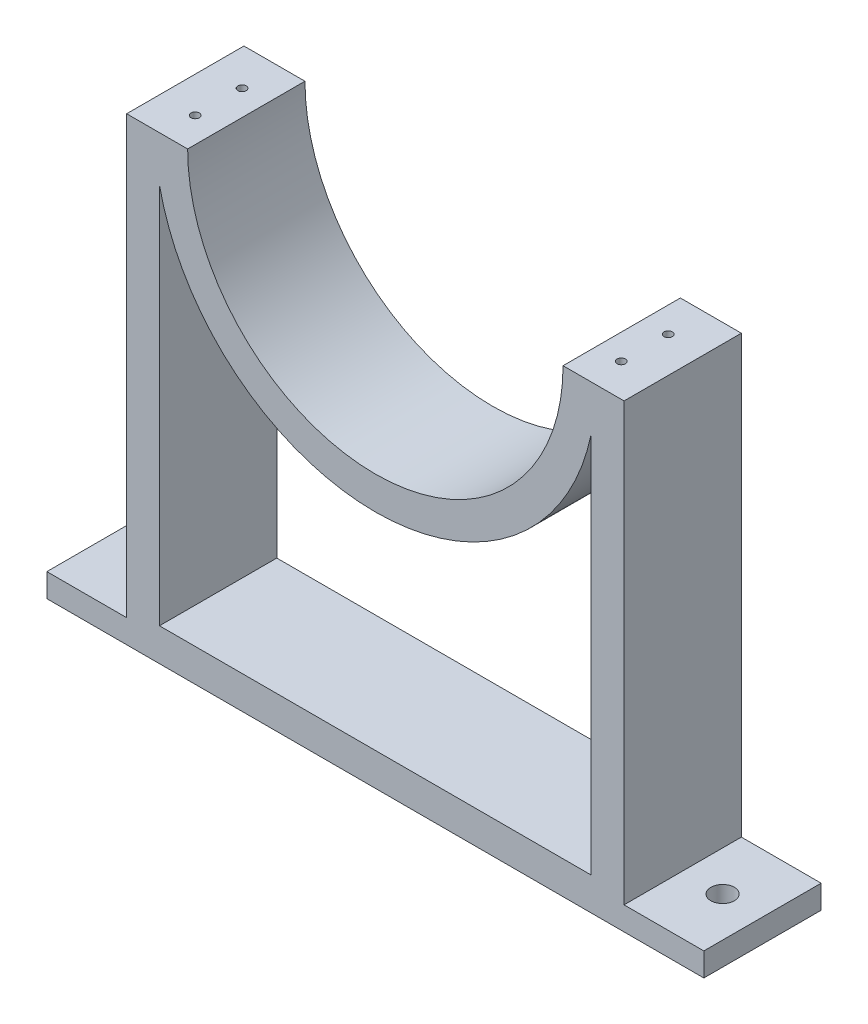
ISO-10303-21;
HEADER;
FILE_DESCRIPTION(('STEP AP214'),'2;1');
FILE_NAME('part.step','',(''),(''),'','','');
FILE_SCHEMA(('AUTOMOTIVE_DESIGN { 1 0 10303 214 1 1 1 1 }'));
ENDSEC;
DATA;
#1=APPLICATION_CONTEXT('core data for automotive mechanical design processes');
#2=APPLICATION_PROTOCOL_DEFINITION('international standard','automotive_design',2000,#1);
#3=PRODUCT_CONTEXT('',#1,'mechanical');
#4=PRODUCT('Part','Part','',(#3));
#5=PRODUCT_RELATED_PRODUCT_CATEGORY('part','',(#4));
#6=PRODUCT_DEFINITION_FORMATION('','',#4);
#7=PRODUCT_DEFINITION_CONTEXT('part definition',#1,'design');
#8=PRODUCT_DEFINITION('design','',#6,#7);
#9=PRODUCT_DEFINITION_SHAPE('','',#8);
#10=(LENGTH_UNIT() NAMED_UNIT(*) SI_UNIT(.MILLI.,.METRE.));
#11=(NAMED_UNIT(*) PLANE_ANGLE_UNIT() SI_UNIT($,.RADIAN.));
#12=(NAMED_UNIT(*) SI_UNIT($,.STERADIAN.) SOLID_ANGLE_UNIT());
#13=UNCERTAINTY_MEASURE_WITH_UNIT(LENGTH_MEASURE(1.E-05),#10,'distance_accuracy_value','');
#14=(GEOMETRIC_REPRESENTATION_CONTEXT(3) GLOBAL_UNCERTAINTY_ASSIGNED_CONTEXT((#13)) GLOBAL_UNIT_ASSIGNED_CONTEXT((#10,
#11,#12)) REPRESENTATION_CONTEXT('',''));
#15=CARTESIAN_POINT('',(0.,0.,0.));
#16=DIRECTION('',(0.,0.,1.));
#17=DIRECTION('',(1.,0.,0.));
#18=AXIS2_PLACEMENT_3D('',#15,#16,#17);
#19=CARTESIAN_POINT('',(0.,0.,15.875));
#20=DIRECTION('',(0.,0.,1.));
#21=DIRECTION('',(1.,0.,0.));
#22=AXIS2_PLACEMENT_3D('',#19,#20,#21);
#23=PLANE('',#22);
#24=CARTESIAN_POINT('',(0.,0.,15.875));
#25=DIRECTION('',(0.,0.,1.));
#26=DIRECTION('',(1.,0.,0.));
#27=AXIS2_PLACEMENT_3D('',#24,#25,#26);
#28=CIRCLE('',#27,50.8);
#29=CARTESIAN_POINT('',(-50.8,0.,15.875));
#30=VERTEX_POINT('',#29);
#31=CARTESIAN_POINT('',(50.8,0.,15.875));
#32=VERTEX_POINT('',#31);
#33=EDGE_CURVE('E284',#30,#32,#28,.T.);
#34=ORIENTED_EDGE('',*,*,#33,.F.);
#35=DIRECTION('',(-1.,0.,0.));
#36=VECTOR('',#35,1.);
#37=CARTESIAN_POINT('',(0.,0.,15.875));
#38=LINE('',#37,#36);
#39=CARTESIAN_POINT('',(-67.31,0.,15.875));
#40=VERTEX_POINT('',#39);
#41=EDGE_CURVE('E287',#30,#40,#38,.T.);
#42=ORIENTED_EDGE('',*,*,#41,.T.);
#43=DIRECTION('',(0.,-1.,0.));
#44=VECTOR('',#43,1.);
#45=CARTESIAN_POINT('',(-67.31,0.,15.875));
#46=LINE('',#45,#44);
#47=CARTESIAN_POINT('',(-67.31,-118.11,15.875));
#48=VERTEX_POINT('',#47);
#49=EDGE_CURVE('E290',#40,#48,#46,.T.);
#50=ORIENTED_EDGE('',*,*,#49,.T.);
#51=DIRECTION('',(-1.,0.,0.));
#52=VECTOR('',#51,1.);
#53=CARTESIAN_POINT('',(0.,-118.11,15.875));
#54=LINE('',#53,#52);
#55=CARTESIAN_POINT('',(-88.8999999999999,-118.11,15.875));
#56=VERTEX_POINT('',#55);
#57=EDGE_CURVE('E292',#48,#56,#54,.T.);
#58=ORIENTED_EDGE('',*,*,#57,.T.);
#59=DIRECTION('',(0.,-1.,0.));
#60=VECTOR('',#59,1.);
#61=CARTESIAN_POINT('',(-88.8999999999997,1.94289029309402E-13,15.875));
#62=LINE('',#61,#60);
#63=CARTESIAN_POINT('',(-88.9,-124.46,15.875));
#64=VERTEX_POINT('',#63);
#65=EDGE_CURVE('E294',#56,#64,#62,.T.);
#66=ORIENTED_EDGE('',*,*,#65,.T.);
#67=DIRECTION('',(1.,0.,0.));
#68=VECTOR('',#67,1.);
#69=CARTESIAN_POINT('',(0.,-124.46,15.875));
#70=LINE('',#69,#68);
#71=CARTESIAN_POINT('',(88.9,-124.46,15.875));
#72=VERTEX_POINT('',#71);
#73=EDGE_CURVE('E296',#64,#72,#70,.T.);
#74=ORIENTED_EDGE('',*,*,#73,.T.);
#75=DIRECTION('',(0.,-1.,0.));
#76=VECTOR('',#75,1.);
#77=CARTESIAN_POINT('',(88.8999999999997,1.94289029309402E-13,15.875));
#78=LINE('',#77,#76);
#79=CARTESIAN_POINT('',(88.9,-118.11,15.875));
#80=VERTEX_POINT('',#79);
#81=EDGE_CURVE('E298',#80,#72,#78,.T.);
#82=ORIENTED_EDGE('',*,*,#81,.F.);
#83=DIRECTION('',(1.,0.,0.));
#84=VECTOR('',#83,1.);
#85=CARTESIAN_POINT('',(1.51839325426676E-13,-118.11,15.875));
#86=LINE('',#85,#84);
#87=CARTESIAN_POINT('',(67.31,-118.11,15.875));
#88=VERTEX_POINT('',#87);
#89=EDGE_CURVE('E301',#88,#80,#86,.T.);
#90=ORIENTED_EDGE('',*,*,#89,.F.);
#91=DIRECTION('',(0.,-1.,0.));
#92=VECTOR('',#91,1.);
#93=CARTESIAN_POINT('',(67.31,0.,15.875));
#94=LINE('',#93,#92);
#95=CARTESIAN_POINT('',(67.31,0.,15.875));
#96=VERTEX_POINT('',#95);
#97=EDGE_CURVE('E304',#96,#88,#94,.T.);
#98=ORIENTED_EDGE('',*,*,#97,.F.);
#99=DIRECTION('',(1.,0.,0.));
#100=VECTOR('',#99,1.);
#101=CARTESIAN_POINT('',(0.,0.,15.875));
#102=LINE('',#101,#100);
#103=EDGE_CURVE('E307',#32,#96,#102,.T.);
#104=ORIENTED_EDGE('',*,*,#103,.F.);
#105=EDGE_LOOP('',(#34,#42,#50,#58,#66,#74,#82,#90,#98,#104));
#106=FACE_BOUND('',#105,.T.);
#107=CARTESIAN_POINT('',(0.,0.,15.875));
#108=DIRECTION('',(0.,0.,1.));
#109=DIRECTION('',(1.,0.,0.));
#110=AXIS2_PLACEMENT_3D('',#107,#108,#109);
#111=CIRCLE('',#110,59.69);
#112=CARTESIAN_POINT('',(-58.42,-12.2474364664611,15.875));
#113=VERTEX_POINT('',#112);
#114=CARTESIAN_POINT('',(58.42,-12.247436466461,15.875));
#115=VERTEX_POINT('',#114);
#116=EDGE_CURVE('E260',#113,#115,#111,.T.);
#117=ORIENTED_EDGE('',*,*,#116,.T.);
#118=DIRECTION('',(0.,-1.,0.));
#119=VECTOR('',#118,1.);
#120=CARTESIAN_POINT('',(58.42,0.,15.875));
#121=LINE('',#120,#119);
#122=CARTESIAN_POINT('',(58.42,-115.57,15.875));
#123=VERTEX_POINT('',#122);
#124=EDGE_CURVE('E272',#115,#123,#121,.T.);
#125=ORIENTED_EDGE('',*,*,#124,.T.);
#126=DIRECTION('',(1.,0.,0.));
#127=VECTOR('',#126,1.);
#128=CARTESIAN_POINT('',(0.,-115.57,15.875));
#129=LINE('',#128,#127);
#130=CARTESIAN_POINT('',(-58.42,-115.57,15.875));
#131=VERTEX_POINT('',#130);
#132=EDGE_CURVE('E269',#131,#123,#129,.T.);
#133=ORIENTED_EDGE('',*,*,#132,.F.);
#134=DIRECTION('',(0.,-1.,0.));
#135=VECTOR('',#134,1.);
#136=CARTESIAN_POINT('',(-58.42,0.,15.875));
#137=LINE('',#136,#135);
#138=EDGE_CURVE('E123',#113,#131,#137,.T.);
#139=ORIENTED_EDGE('',*,*,#138,.F.);
#140=EDGE_LOOP('',(#117,#125,#133,#139));
#141=FACE_BOUND('',#140,.T.);
#142=ADVANCED_FACE('F100',(#106,#141),#23,.T.);
#143=CARTESIAN_POINT('',(0.,0.,15.875));
#144=DIRECTION('',(0.,0.,-1.));
#145=DIRECTION('',(-1.,0.,0.));
#146=AXIS2_PLACEMENT_3D('',#143,#144,#145);
#147=CYLINDRICAL_SURFACE('',#146,50.8);
#148=CARTESIAN_POINT('',(0.,0.,-15.875));
#149=DIRECTION('',(0.,0.,1.));
#150=DIRECTION('',(1.,0.,0.));
#151=AXIS2_PLACEMENT_3D('',#148,#149,#150);
#152=CIRCLE('',#151,50.8);
#153=CARTESIAN_POINT('',(-50.8,0.,-15.875));
#154=VERTEX_POINT('',#153);
#155=CARTESIAN_POINT('',(50.8,0.,-15.875));
#156=VERTEX_POINT('',#155);
#157=EDGE_CURVE('E283',#154,#156,#152,.T.);
#158=ORIENTED_EDGE('',*,*,#157,.F.);
#159=DIRECTION('',(0.,0.,-1.));
#160=VECTOR('',#159,1.);
#161=CARTESIAN_POINT('',(-50.8,0.,15.875));
#162=LINE('',#161,#160);
#163=EDGE_CURVE('E12',#30,#154,#162,.T.);
#164=ORIENTED_EDGE('',*,*,#163,.F.);
#165=ORIENTED_EDGE('',*,*,#33,.T.);
#166=DIRECTION('',(0.,0.,-1.));
#167=VECTOR('',#166,1.);
#168=CARTESIAN_POINT('',(50.8,0.,15.875));
#169=LINE('',#168,#167);
#170=EDGE_CURVE('E310',#32,#156,#169,.T.);
#171=ORIENTED_EDGE('',*,*,#170,.T.);
#172=EDGE_LOOP('',(#158,#164,#165,#171));
#173=FACE_BOUND('',#172,.T.);
#174=ADVANCED_FACE('F102',(#173),#147,.F.);
#175=CARTESIAN_POINT('',(0.,0.,-15.875));
#176=DIRECTION('',(0.,0.,1.));
#177=DIRECTION('',(1.,0.,0.));
#178=AXIS2_PLACEMENT_3D('',#175,#176,#177);
#179=PLANE('',#178);
#180=CARTESIAN_POINT('',(0.,0.,-15.875));
#181=DIRECTION('',(0.,0.,1.));
#182=DIRECTION('',(1.,0.,0.));
#183=AXIS2_PLACEMENT_3D('',#180,#181,#182);
#184=CIRCLE('',#183,59.69);
#185=CARTESIAN_POINT('',(-58.42,-12.2474364664611,-15.875));
#186=VERTEX_POINT('',#185);
#187=CARTESIAN_POINT('',(58.42,-12.247436466461,-15.875));
#188=VERTEX_POINT('',#187);
#189=EDGE_CURVE('E247',#186,#188,#184,.T.);
#190=ORIENTED_EDGE('',*,*,#189,.F.);
#191=DIRECTION('',(0.,-1.,0.));
#192=VECTOR('',#191,1.);
#193=CARTESIAN_POINT('',(-58.42,0.,-15.875));
#194=LINE('',#193,#192);
#195=CARTESIAN_POINT('',(-58.42,-115.57,-15.875));
#196=VERTEX_POINT('',#195);
#197=EDGE_CURVE('E258',#186,#196,#194,.T.);
#198=ORIENTED_EDGE('',*,*,#197,.T.);
#199=DIRECTION('',(1.,0.,0.));
#200=VECTOR('',#199,1.);
#201=CARTESIAN_POINT('',(0.,-115.57,-15.875));
#202=LINE('',#201,#200);
#203=CARTESIAN_POINT('',(58.42,-115.57,-15.875));
#204=VERTEX_POINT('',#203);
#205=EDGE_CURVE('E261',#196,#204,#202,.T.);
#206=ORIENTED_EDGE('',*,*,#205,.T.);
#207=DIRECTION('',(0.,-1.,0.));
#208=VECTOR('',#207,1.);
#209=CARTESIAN_POINT('',(58.42,0.,-15.875));
#210=LINE('',#209,#208);
#211=EDGE_CURVE('E115',#188,#204,#210,.T.);
#212=ORIENTED_EDGE('',*,*,#211,.F.);
#213=EDGE_LOOP('',(#190,#198,#206,#212));
#214=FACE_BOUND('',#213,.T.);
#215=ORIENTED_EDGE('',*,*,#157,.T.);
#216=DIRECTION('',(1.,0.,0.));
#217=VECTOR('',#216,1.);
#218=CARTESIAN_POINT('',(0.,0.,-15.875));
#219=LINE('',#218,#217);
#220=CARTESIAN_POINT('',(67.31,0.,-15.875));
#221=VERTEX_POINT('',#220);
#222=EDGE_CURVE('E288',#156,#221,#219,.T.);
#223=ORIENTED_EDGE('',*,*,#222,.T.);
#224=DIRECTION('',(0.,-1.,0.));
#225=VECTOR('',#224,1.);
#226=CARTESIAN_POINT('',(67.31,0.,-15.875));
#227=LINE('',#226,#225);
#228=CARTESIAN_POINT('',(67.31,-118.11,-15.875));
#229=VERTEX_POINT('',#228);
#230=EDGE_CURVE('E330',#221,#229,#227,.T.);
#231=ORIENTED_EDGE('',*,*,#230,.T.);
#232=DIRECTION('',(1.,0.,0.));
#233=VECTOR('',#232,1.);
#234=CARTESIAN_POINT('',(1.51839325426676E-13,-118.11,-15.875));
#235=LINE('',#234,#233);
#236=CARTESIAN_POINT('',(88.9,-118.11,-15.875));
#237=VERTEX_POINT('',#236);
#238=EDGE_CURVE('E327',#229,#237,#235,.T.);
#239=ORIENTED_EDGE('',*,*,#238,.T.);
#240=DIRECTION('',(0.,-1.,0.));
#241=VECTOR('',#240,1.);
#242=CARTESIAN_POINT('',(88.8999999999997,1.94289029309402E-13,-15.875));
#243=LINE('',#242,#241);
#244=CARTESIAN_POINT('',(88.9,-124.46,-15.875));
#245=VERTEX_POINT('',#244);
#246=EDGE_CURVE('E324',#237,#245,#243,.T.);
#247=ORIENTED_EDGE('',*,*,#246,.T.);
#248=DIRECTION('',(1.,0.,0.));
#249=VECTOR('',#248,1.);
#250=CARTESIAN_POINT('',(0.,-124.46,-15.875));
#251=LINE('',#250,#249);
#252=CARTESIAN_POINT('',(-88.9,-124.46,-15.875));
#253=VERTEX_POINT('',#252);
#254=EDGE_CURVE('E321',#253,#245,#251,.T.);
#255=ORIENTED_EDGE('',*,*,#254,.F.);
#256=DIRECTION('',(0.,-1.,0.));
#257=VECTOR('',#256,1.);
#258=CARTESIAN_POINT('',(-88.8999999999997,1.94289029309402E-13,-15.875));
#259=LINE('',#258,#257);
#260=CARTESIAN_POINT('',(-88.8999999999999,-118.11,-15.875));
#261=VERTEX_POINT('',#260);
#262=EDGE_CURVE('E319',#261,#253,#259,.T.);
#263=ORIENTED_EDGE('',*,*,#262,.F.);
#264=DIRECTION('',(-1.,0.,0.));
#265=VECTOR('',#264,1.);
#266=CARTESIAN_POINT('',(0.,-118.11,-15.875));
#267=LINE('',#266,#265);
#268=CARTESIAN_POINT('',(-67.31,-118.11,-15.875));
#269=VERTEX_POINT('',#268);
#270=EDGE_CURVE('E317',#269,#261,#267,.T.);
#271=ORIENTED_EDGE('',*,*,#270,.F.);
#272=DIRECTION('',(0.,-1.,0.));
#273=VECTOR('',#272,1.);
#274=CARTESIAN_POINT('',(-67.31,0.,-15.875));
#275=LINE('',#274,#273);
#276=CARTESIAN_POINT('',(-67.31,0.,-15.875));
#277=VERTEX_POINT('',#276);
#278=EDGE_CURVE('E315',#277,#269,#275,.T.);
#279=ORIENTED_EDGE('',*,*,#278,.F.);
#280=DIRECTION('',(-1.,0.,0.));
#281=VECTOR('',#280,1.);
#282=CARTESIAN_POINT('',(0.,0.,-15.875));
#283=LINE('',#282,#281);
#284=EDGE_CURVE('E313',#154,#277,#283,.T.);
#285=ORIENTED_EDGE('',*,*,#284,.F.);
#286=EDGE_LOOP('',(#215,#223,#231,#239,#247,#255,#263,#271,#279,#285));
#287=FACE_BOUND('',#286,.T.);
#288=ADVANCED_FACE('F364',(#214,#287),#179,.F.);
#289=CARTESIAN_POINT('',(0.,0.,15.875));
#290=DIRECTION('',(0.,1.,0.));
#291=DIRECTION('',(-1.,0.,0.));
#292=AXIS2_PLACEMENT_3D('',#289,#290,#291);
#293=PLANE('',#292);
#294=CARTESIAN_POINT('',(57.658,0.,6.985));
#295=DIRECTION('',(0.,1.,0.));
#296=DIRECTION('',(0.,0.,1.));
#297=AXIS2_PLACEMENT_3D('',#294,#295,#296);
#298=CIRCLE('',#297,1.13029999999999);
#299=CARTESIAN_POINT('',(57.658,0.,8.1153));
#300=VERTEX_POINT('',#299);
#301=EDGE_CURVE('E231',#300,#300,#298,.T.);
#302=ORIENTED_EDGE('',*,*,#301,.F.);
#303=EDGE_LOOP('',(#302));
#304=FACE_BOUND('',#303,.T.);
#305=CARTESIAN_POINT('',(57.658,0.,-5.715));
#306=DIRECTION('',(0.,1.,0.));
#307=DIRECTION('',(0.,0.,1.));
#308=AXIS2_PLACEMENT_3D('',#305,#306,#307);
#309=CIRCLE('',#308,1.13029999999999);
#310=CARTESIAN_POINT('',(57.658,0.,-4.5847));
#311=VERTEX_POINT('',#310);
#312=EDGE_CURVE('E237',#311,#311,#309,.T.);
#313=ORIENTED_EDGE('',*,*,#312,.F.);
#314=EDGE_LOOP('',(#313));
#315=FACE_BOUND('',#314,.T.);
#316=ORIENTED_EDGE('',*,*,#222,.F.);
#317=ORIENTED_EDGE('',*,*,#170,.F.);
#318=ORIENTED_EDGE('',*,*,#103,.T.);
#319=DIRECTION('',(0.,0.,-1.));
#320=VECTOR('',#319,1.);
#321=CARTESIAN_POINT('',(67.31,0.,15.875));
#322=LINE('',#321,#320);
#323=EDGE_CURVE('E336',#96,#221,#322,.T.);
#324=ORIENTED_EDGE('',*,*,#323,.T.);
#325=EDGE_LOOP('',(#316,#317,#318,#324));
#326=FACE_BOUND('',#325,.T.);
#327=ADVANCED_FACE('F387',(#304,#315,#326),#293,.T.);
#328=CARTESIAN_POINT('',(67.31,0.,15.875));
#329=DIRECTION('',(1.,0.,0.));
#330=DIRECTION('',(0.,1.,0.));
#331=AXIS2_PLACEMENT_3D('',#328,#329,#330);
#332=PLANE('',#331);
#333=ORIENTED_EDGE('',*,*,#230,.F.);
#334=ORIENTED_EDGE('',*,*,#323,.F.);
#335=ORIENTED_EDGE('',*,*,#97,.T.);
#336=DIRECTION('',(0.,0.,-1.));
#337=VECTOR('',#336,1.);
#338=CARTESIAN_POINT('',(67.31,-118.11,15.875));
#339=LINE('',#338,#337);
#340=EDGE_CURVE('E338',#88,#229,#339,.T.);
#341=ORIENTED_EDGE('',*,*,#340,.T.);
#342=EDGE_LOOP('',(#333,#334,#335,#341));
#343=FACE_BOUND('',#342,.T.);
#344=ADVANCED_FACE('F391',(#343),#332,.T.);
#345=CARTESIAN_POINT('',(1.51839325426676E-13,-118.11,15.875));
#346=DIRECTION('',(0.,1.,0.));
#347=DIRECTION('',(-1.,0.,0.));
#348=AXIS2_PLACEMENT_3D('',#345,#346,#347);
#349=PLANE('',#348);
#350=CARTESIAN_POINT('',(78.1049999999999,-118.11,0.));
#351=DIRECTION('',(0.,1.,0.));
#352=DIRECTION('',(0.,0.,-1.));
#353=AXIS2_PLACEMENT_3D('',#350,#351,#352);
#354=CIRCLE('',#353,3.175);
#355=CARTESIAN_POINT('',(78.1049999999999,-118.11,-3.175));
#356=VERTEX_POINT('',#355);
#357=EDGE_CURVE('E243',#356,#356,#354,.T.);
#358=ORIENTED_EDGE('',*,*,#357,.F.);
#359=EDGE_LOOP('',(#358));
#360=FACE_BOUND('',#359,.T.);
#361=ORIENTED_EDGE('',*,*,#238,.F.);
#362=ORIENTED_EDGE('',*,*,#340,.F.);
#363=ORIENTED_EDGE('',*,*,#89,.T.);
#364=DIRECTION('',(0.,0.,-1.));
#365=VECTOR('',#364,1.);
#366=CARTESIAN_POINT('',(88.9,-118.11,15.875));
#367=LINE('',#366,#365);
#368=EDGE_CURVE('E340',#80,#237,#367,.T.);
#369=ORIENTED_EDGE('',*,*,#368,.T.);
#370=EDGE_LOOP('',(#361,#362,#363,#369));
#371=FACE_BOUND('',#370,.T.);
#372=ADVANCED_FACE('F395',(#360,#371),#349,.T.);
#373=CARTESIAN_POINT('',(88.8999999999997,1.94289029309402E-13,15.875));
#374=DIRECTION('',(1.,0.,0.));
#375=DIRECTION('',(0.,1.,0.));
#376=AXIS2_PLACEMENT_3D('',#373,#374,#375);
#377=PLANE('',#376);
#378=ORIENTED_EDGE('',*,*,#246,.F.);
#379=ORIENTED_EDGE('',*,*,#368,.F.);
#380=ORIENTED_EDGE('',*,*,#81,.T.);
#381=DIRECTION('',(0.,0.,-1.));
#382=VECTOR('',#381,1.);
#383=CARTESIAN_POINT('',(88.9,-124.46,15.875));
#384=LINE('',#383,#382);
#385=EDGE_CURVE('E342',#72,#245,#384,.T.);
#386=ORIENTED_EDGE('',*,*,#385,.T.);
#387=EDGE_LOOP('',(#378,#379,#380,#386));
#388=FACE_BOUND('',#387,.T.);
#389=ADVANCED_FACE('F398',(#388),#377,.T.);
#390=CARTESIAN_POINT('',(0.,-124.46,15.875));
#391=DIRECTION('',(0.,1.,0.));
#392=DIRECTION('',(-1.,0.,0.));
#393=AXIS2_PLACEMENT_3D('',#390,#391,#392);
#394=PLANE('',#393);
#395=CARTESIAN_POINT('',(-78.105,-124.46,0.));
#396=DIRECTION('',(0.,1.,0.));
#397=DIRECTION('',(0.,0.,1.));
#398=AXIS2_PLACEMENT_3D('',#395,#396,#397);
#399=CIRCLE('',#398,3.175);
#400=CARTESIAN_POINT('',(-78.105,-124.46,3.175));
#401=VERTEX_POINT('',#400);
#402=EDGE_CURVE('E244',#401,#401,#399,.T.);
#403=ORIENTED_EDGE('',*,*,#402,.T.);
#404=EDGE_LOOP('',(#403));
#405=FACE_BOUND('',#404,.T.);
#406=CARTESIAN_POINT('',(78.1049999999999,-124.46,0.));
#407=DIRECTION('',(0.,1.,0.));
#408=DIRECTION('',(0.,0.,-1.));
#409=AXIS2_PLACEMENT_3D('',#406,#407,#408);
#410=CIRCLE('',#409,3.175);
#411=CARTESIAN_POINT('',(78.1049999999999,-124.46,-3.175));
#412=VERTEX_POINT('',#411);
#413=EDGE_CURVE('E251',#412,#412,#410,.T.);
#414=ORIENTED_EDGE('',*,*,#413,.T.);
#415=EDGE_LOOP('',(#414));
#416=FACE_BOUND('',#415,.T.);
#417=ORIENTED_EDGE('',*,*,#254,.T.);
#418=ORIENTED_EDGE('',*,*,#385,.F.);
#419=ORIENTED_EDGE('',*,*,#73,.F.);
#420=DIRECTION('',(0.,0.,-1.));
#421=VECTOR('',#420,1.);
#422=CARTESIAN_POINT('',(-88.9,-124.46,15.875));
#423=LINE('',#422,#421);
#424=EDGE_CURVE('E344',#64,#253,#423,.T.);
#425=ORIENTED_EDGE('',*,*,#424,.T.);
#426=EDGE_LOOP('',(#417,#418,#419,#425));
#427=FACE_BOUND('',#426,.T.);
#428=ADVANCED_FACE('F400',(#405,#416,#427),#394,.F.);
#429=CARTESIAN_POINT('',(-88.8999999999997,1.94289029309402E-13,15.875));
#430=DIRECTION('',(1.,0.,0.));
#431=DIRECTION('',(0.,1.,0.));
#432=AXIS2_PLACEMENT_3D('',#429,#430,#431);
#433=PLANE('',#432);
#434=ORIENTED_EDGE('',*,*,#262,.T.);
#435=ORIENTED_EDGE('',*,*,#424,.F.);
#436=ORIENTED_EDGE('',*,*,#65,.F.);
#437=DIRECTION('',(0.,0.,-1.));
#438=VECTOR('',#437,1.);
#439=CARTESIAN_POINT('',(-88.8999999999999,-118.11,15.875));
#440=LINE('',#439,#438);
#441=EDGE_CURVE('E347',#56,#261,#440,.T.);
#442=ORIENTED_EDGE('',*,*,#441,.T.);
#443=EDGE_LOOP('',(#434,#435,#436,#442));
#444=FACE_BOUND('',#443,.T.);
#445=ADVANCED_FACE('F374',(#444),#433,.F.);
#446=CARTESIAN_POINT('',(0.,-118.11,15.875));
#447=DIRECTION('',(0.,-1.,0.));
#448=DIRECTION('',(1.,0.,0.));
#449=AXIS2_PLACEMENT_3D('',#446,#447,#448);
#450=PLANE('',#449);
#451=CARTESIAN_POINT('',(-78.105,-118.11,0.));
#452=DIRECTION('',(0.,1.,0.));
#453=DIRECTION('',(0.,0.,1.));
#454=AXIS2_PLACEMENT_3D('',#451,#452,#453);
#455=CIRCLE('',#454,3.175);
#456=CARTESIAN_POINT('',(-78.105,-118.11,3.175));
#457=VERTEX_POINT('',#456);
#458=EDGE_CURVE('E248',#457,#457,#455,.T.);
#459=ORIENTED_EDGE('',*,*,#458,.F.);
#460=EDGE_LOOP('',(#459));
#461=FACE_BOUND('',#460,.T.);
#462=ORIENTED_EDGE('',*,*,#270,.T.);
#463=ORIENTED_EDGE('',*,*,#441,.F.);
#464=ORIENTED_EDGE('',*,*,#57,.F.);
#465=DIRECTION('',(0.,0.,-1.));
#466=VECTOR('',#465,1.);
#467=CARTESIAN_POINT('',(-67.31,-118.11,15.875));
#468=LINE('',#467,#466);
#469=EDGE_CURVE('E350',#48,#269,#468,.T.);
#470=ORIENTED_EDGE('',*,*,#469,.T.);
#471=EDGE_LOOP('',(#462,#463,#464,#470));
#472=FACE_BOUND('',#471,.T.);
#473=ADVANCED_FACE('F370',(#461,#472),#450,.F.);
#474=CARTESIAN_POINT('',(-67.31,0.,15.875));
#475=DIRECTION('',(1.,0.,0.));
#476=DIRECTION('',(0.,1.,0.));
#477=AXIS2_PLACEMENT_3D('',#474,#475,#476);
#478=PLANE('',#477);
#479=ORIENTED_EDGE('',*,*,#278,.T.);
#480=ORIENTED_EDGE('',*,*,#469,.F.);
#481=ORIENTED_EDGE('',*,*,#49,.F.);
#482=DIRECTION('',(0.,0.,-1.));
#483=VECTOR('',#482,1.);
#484=CARTESIAN_POINT('',(-67.31,0.,15.875));
#485=LINE('',#484,#483);
#486=EDGE_CURVE('E108',#40,#277,#485,.T.);
#487=ORIENTED_EDGE('',*,*,#486,.T.);
#488=EDGE_LOOP('',(#479,#480,#481,#487));
#489=FACE_BOUND('',#488,.T.);
#490=ADVANCED_FACE('F357',(#489),#478,.F.);
#491=CARTESIAN_POINT('',(0.,0.,15.875));
#492=DIRECTION('',(0.,-1.,0.));
#493=DIRECTION('',(1.,0.,0.));
#494=AXIS2_PLACEMENT_3D('',#491,#492,#493);
#495=PLANE('',#494);
#496=CARTESIAN_POINT('',(-57.658,0.,-5.715));
#497=DIRECTION('',(0.,1.,0.));
#498=DIRECTION('',(0.,0.,1.));
#499=AXIS2_PLACEMENT_3D('',#496,#497,#498);
#500=CIRCLE('',#499,1.13029999999999);
#501=CARTESIAN_POINT('',(-57.658,0.,-4.5847));
#502=VERTEX_POINT('',#501);
#503=EDGE_CURVE('E221',#502,#502,#500,.T.);
#504=ORIENTED_EDGE('',*,*,#503,.F.);
#505=EDGE_LOOP('',(#504));
#506=FACE_BOUND('',#505,.T.);
#507=CARTESIAN_POINT('',(-57.658,0.,6.985));
#508=DIRECTION('',(0.,1.,0.));
#509=DIRECTION('',(0.,0.,1.));
#510=AXIS2_PLACEMENT_3D('',#507,#508,#509);
#511=CIRCLE('',#510,1.13029999999999);
#512=CARTESIAN_POINT('',(-57.658,0.,8.1153));
#513=VERTEX_POINT('',#512);
#514=EDGE_CURVE('E220',#513,#513,#511,.T.);
#515=ORIENTED_EDGE('',*,*,#514,.F.);
#516=EDGE_LOOP('',(#515));
#517=FACE_BOUND('',#516,.T.);
#518=ORIENTED_EDGE('',*,*,#284,.T.);
#519=ORIENTED_EDGE('',*,*,#486,.F.);
#520=ORIENTED_EDGE('',*,*,#41,.F.);
#521=ORIENTED_EDGE('',*,*,#163,.T.);
#522=EDGE_LOOP('',(#518,#519,#520,#521));
#523=FACE_BOUND('',#522,.T.);
#524=ADVANCED_FACE('F383',(#506,#517,#523),#495,.F.);
#525=CARTESIAN_POINT('',(0.,0.,15.875));
#526=DIRECTION('',(0.,0.,-1.));
#527=DIRECTION('',(-1.,0.,0.));
#528=AXIS2_PLACEMENT_3D('',#525,#526,#527);
#529=CYLINDRICAL_SURFACE('',#528,59.69);
#530=ORIENTED_EDGE('',*,*,#116,.F.);
#531=DIRECTION('',(0.,0.,-1.));
#532=VECTOR('',#531,1.);
#533=CARTESIAN_POINT('',(-58.42,-12.2474364664611,15.875));
#534=LINE('',#533,#532);
#535=EDGE_CURVE('E275',#186,#113,#534,.F.);
#536=ORIENTED_EDGE('',*,*,#535,.F.);
#537=ORIENTED_EDGE('',*,*,#189,.T.);
#538=DIRECTION('',(0.,0.,-1.));
#539=VECTOR('',#538,1.);
#540=CARTESIAN_POINT('',(58.42,-12.247436466461,15.875));
#541=LINE('',#540,#539);
#542=EDGE_CURVE('E277',#115,#188,#541,.T.);
#543=ORIENTED_EDGE('',*,*,#542,.F.);
#544=EDGE_LOOP('',(#530,#536,#537,#543));
#545=FACE_BOUND('',#544,.T.);
#546=ADVANCED_FACE('F453',(#545),#529,.T.);
#547=CARTESIAN_POINT('',(58.42,0.,15.875));
#548=DIRECTION('',(1.,0.,0.));
#549=DIRECTION('',(0.,1.,0.));
#550=AXIS2_PLACEMENT_3D('',#547,#548,#549);
#551=PLANE('',#550);
#552=DIRECTION('',(0.,0.,1.));
#553=VECTOR('',#552,1.);
#554=CARTESIAN_POINT('',(58.42,-115.57,15.875));
#555=LINE('',#554,#553);
#556=EDGE_CURVE('E281',#204,#123,#555,.T.);
#557=ORIENTED_EDGE('',*,*,#556,.T.);
#558=ORIENTED_EDGE('',*,*,#124,.F.);
#559=ORIENTED_EDGE('',*,*,#542,.T.);
#560=ORIENTED_EDGE('',*,*,#211,.T.);
#561=EDGE_LOOP('',(#557,#558,#559,#560));
#562=FACE_BOUND('',#561,.T.);
#563=ADVANCED_FACE('F456',(#562),#551,.F.);
#564=CARTESIAN_POINT('',(0.,-115.57,15.875));
#565=DIRECTION('',(0.,1.,0.));
#566=DIRECTION('',(-1.,0.,0.));
#567=AXIS2_PLACEMENT_3D('',#564,#565,#566);
#568=PLANE('',#567);
#569=ORIENTED_EDGE('',*,*,#205,.F.);
#570=DIRECTION('',(0.,0.,-1.));
#571=VECTOR('',#570,1.);
#572=CARTESIAN_POINT('',(-58.42,-115.57,15.875));
#573=LINE('',#572,#571);
#574=EDGE_CURVE('E279',#131,#196,#573,.T.);
#575=ORIENTED_EDGE('',*,*,#574,.F.);
#576=ORIENTED_EDGE('',*,*,#132,.T.);
#577=ORIENTED_EDGE('',*,*,#556,.F.);
#578=EDGE_LOOP('',(#569,#575,#576,#577));
#579=FACE_BOUND('',#578,.T.);
#580=ADVANCED_FACE('F460',(#579),#568,.T.);
#581=CARTESIAN_POINT('',(-58.42,0.,15.875));
#582=DIRECTION('',(1.,0.,0.));
#583=DIRECTION('',(0.,1.,0.));
#584=AXIS2_PLACEMENT_3D('',#581,#582,#583);
#585=PLANE('',#584);
#586=ORIENTED_EDGE('',*,*,#574,.T.);
#587=ORIENTED_EDGE('',*,*,#197,.F.);
#588=ORIENTED_EDGE('',*,*,#535,.T.);
#589=ORIENTED_EDGE('',*,*,#138,.T.);
#590=EDGE_LOOP('',(#586,#587,#588,#589));
#591=FACE_BOUND('',#590,.T.);
#592=ADVANCED_FACE('F448',(#591),#585,.T.);
#593=CARTESIAN_POINT('',(-78.105,-124.46,0.));
#594=DIRECTION('',(0.,1.,0.));
#595=DIRECTION('',(0.,0.,1.));
#596=AXIS2_PLACEMENT_3D('',#593,#594,#595);
#597=CYLINDRICAL_SURFACE('',#596,3.175);
#598=ORIENTED_EDGE('',*,*,#402,.F.);
#599=EDGE_LOOP('',(#598));
#600=FACE_BOUND('',#599,.T.);
#601=ORIENTED_EDGE('',*,*,#458,.T.);
#602=EDGE_LOOP('',(#601));
#603=FACE_BOUND('',#602,.T.);
#604=ADVANCED_FACE('F438',(#600,#603),#597,.F.);
#605=CARTESIAN_POINT('',(78.1049999999999,-124.46,0.));
#606=DIRECTION('',(0.,1.,0.));
#607=DIRECTION('',(0.,0.,1.));
#608=AXIS2_PLACEMENT_3D('',#605,#606,#607);
#609=CYLINDRICAL_SURFACE('',#608,3.175);
#610=ORIENTED_EDGE('',*,*,#413,.F.);
#611=EDGE_LOOP('',(#610));
#612=FACE_BOUND('',#611,.T.);
#613=ORIENTED_EDGE('',*,*,#357,.T.);
#614=EDGE_LOOP('',(#613));
#615=FACE_BOUND('',#614,.T.);
#616=ADVANCED_FACE('F435',(#612,#615),#609,.F.);
#617=CARTESIAN_POINT('',(57.658,-7.61999999999998,-5.715));
#618=DIRECTION('',(0.,1.,0.));
#619=DIRECTION('',(0.,0.,1.));
#620=AXIS2_PLACEMENT_3D('',#617,#618,#619);
#621=CONICAL_SURFACE('',#620,1.13029999999999,1.02974425867665);
#622=CARTESIAN_POINT('',(57.658,-8.29915275768683,-5.715));
#623=VERTEX_POINT('',#622);
#624=VERTEX_LOOP('',#623);
#625=FACE_BOUND('',#624,.T.);
#626=CARTESIAN_POINT('',(57.658,-7.61999999999998,-5.715));
#627=DIRECTION('',(0.,1.,0.));
#628=DIRECTION('',(0.,0.,1.));
#629=AXIS2_PLACEMENT_3D('',#626,#627,#628);
#630=CIRCLE('',#629,1.13029999999999);
#631=CARTESIAN_POINT('',(57.658,-7.61999999999998,-4.5847));
#632=VERTEX_POINT('',#631);
#633=EDGE_CURVE('E240',#632,#632,#630,.T.);
#634=ORIENTED_EDGE('',*,*,#633,.T.);
#635=EDGE_LOOP('',(#634));
#636=FACE_BOUND('',#635,.T.);
#637=ADVANCED_FACE('F437',(#625,#636),#621,.F.);
#638=CARTESIAN_POINT('',(57.658,0.,-5.715));
#639=DIRECTION('',(0.,1.,0.));
#640=DIRECTION('',(0.,0.,1.));
#641=AXIS2_PLACEMENT_3D('',#638,#639,#640);
#642=CYLINDRICAL_SURFACE('',#641,1.13029999999999);
#643=ORIENTED_EDGE('',*,*,#633,.F.);
#644=EDGE_LOOP('',(#643));
#645=FACE_BOUND('',#644,.T.);
#646=ORIENTED_EDGE('',*,*,#312,.T.);
#647=EDGE_LOOP('',(#646));
#648=FACE_BOUND('',#647,.T.);
#649=ADVANCED_FACE('F445',(#645,#648),#642,.F.);
#650=CARTESIAN_POINT('',(57.658,-7.61999999999998,6.985));
#651=DIRECTION('',(0.,1.,0.));
#652=DIRECTION('',(0.,0.,1.));
#653=AXIS2_PLACEMENT_3D('',#650,#651,#652);
#654=CONICAL_SURFACE('',#653,1.13029999999999,1.02974425867665);
#655=CARTESIAN_POINT('',(57.658,-8.29915275768683,6.985));
#656=VERTEX_POINT('',#655);
#657=VERTEX_LOOP('',#656);
#658=FACE_BOUND('',#657,.T.);
#659=CARTESIAN_POINT('',(57.658,-7.61999999999998,6.985));
#660=DIRECTION('',(0.,1.,0.));
#661=DIRECTION('',(0.,0.,1.));
#662=AXIS2_PLACEMENT_3D('',#659,#660,#661);
#663=CIRCLE('',#662,1.13029999999999);
#664=CARTESIAN_POINT('',(57.658,-7.61999999999998,8.1153));
#665=VERTEX_POINT('',#664);
#666=EDGE_CURVE('E234',#665,#665,#663,.T.);
#667=ORIENTED_EDGE('',*,*,#666,.T.);
#668=EDGE_LOOP('',(#667));
#669=FACE_BOUND('',#668,.T.);
#670=ADVANCED_FACE('F520',(#658,#669),#654,.F.);
#671=CARTESIAN_POINT('',(57.658,0.,6.985));
#672=DIRECTION('',(0.,1.,0.));
#673=DIRECTION('',(0.,0.,1.));
#674=AXIS2_PLACEMENT_3D('',#671,#672,#673);
#675=CYLINDRICAL_SURFACE('',#674,1.13029999999999);
#676=ORIENTED_EDGE('',*,*,#666,.F.);
#677=EDGE_LOOP('',(#676));
#678=FACE_BOUND('',#677,.T.);
#679=ORIENTED_EDGE('',*,*,#301,.T.);
#680=EDGE_LOOP('',(#679));
#681=FACE_BOUND('',#680,.T.);
#682=ADVANCED_FACE('F531',(#678,#681),#675,.F.);
#683=CARTESIAN_POINT('',(-57.658,-7.62000000000002,6.985));
#684=DIRECTION('',(0.,1.,0.));
#685=DIRECTION('',(0.,0.,1.));
#686=AXIS2_PLACEMENT_3D('',#683,#684,#685);
#687=CONICAL_SURFACE('',#686,1.13029999999999,1.02974425867665);
#688=CARTESIAN_POINT('',(-57.658,-8.29915275768687,6.985));
#689=VERTEX_POINT('',#688);
#690=VERTEX_LOOP('',#689);
#691=FACE_BOUND('',#690,.T.);
#692=CARTESIAN_POINT('',(-57.658,-7.62000000000002,6.985));
#693=DIRECTION('',(0.,1.,0.));
#694=DIRECTION('',(0.,0.,1.));
#695=AXIS2_PLACEMENT_3D('',#692,#693,#694);
#696=CIRCLE('',#695,1.13029999999999);
#697=CARTESIAN_POINT('',(-57.658,-7.62000000000002,8.1153));
#698=VERTEX_POINT('',#697);
#699=EDGE_CURVE('E224',#698,#698,#696,.T.);
#700=ORIENTED_EDGE('',*,*,#699,.T.);
#701=EDGE_LOOP('',(#700));
#702=FACE_BOUND('',#701,.T.);
#703=ADVANCED_FACE('F541',(#691,#702),#687,.F.);
#704=CARTESIAN_POINT('',(-57.658,0.,6.985));
#705=DIRECTION('',(0.,1.,0.));
#706=DIRECTION('',(0.,0.,1.));
#707=AXIS2_PLACEMENT_3D('',#704,#705,#706);
#708=CYLINDRICAL_SURFACE('',#707,1.13029999999999);
#709=ORIENTED_EDGE('',*,*,#699,.F.);
#710=EDGE_LOOP('',(#709));
#711=FACE_BOUND('',#710,.T.);
#712=ORIENTED_EDGE('',*,*,#514,.T.);
#713=EDGE_LOOP('',(#712));
#714=FACE_BOUND('',#713,.T.);
#715=ADVANCED_FACE('F214',(#711,#714),#708,.F.);
#716=CARTESIAN_POINT('',(-57.658,-7.62000000000002,-5.715));
#717=DIRECTION('',(0.,1.,0.));
#718=DIRECTION('',(0.,0.,1.));
#719=AXIS2_PLACEMENT_3D('',#716,#717,#718);
#720=CONICAL_SURFACE('',#719,1.13029999999999,1.02974425867665);
#721=CARTESIAN_POINT('',(-57.658,-8.29915275768687,-5.715));
#722=VERTEX_POINT('',#721);
#723=VERTEX_LOOP('',#722);
#724=FACE_BOUND('',#723,.T.);
#725=CARTESIAN_POINT('',(-57.658,-7.62000000000002,-5.715));
#726=DIRECTION('',(0.,1.,0.));
#727=DIRECTION('',(0.,0.,1.));
#728=AXIS2_PLACEMENT_3D('',#725,#726,#727);
#729=CIRCLE('',#728,1.13029999999999);
#730=CARTESIAN_POINT('',(-57.658,-7.62000000000002,-4.5847));
#731=VERTEX_POINT('',#730);
#732=EDGE_CURVE('E218',#731,#731,#729,.T.);
#733=ORIENTED_EDGE('',*,*,#732,.T.);
#734=EDGE_LOOP('',(#733));
#735=FACE_BOUND('',#734,.T.);
#736=ADVANCED_FACE('F210',(#724,#735),#720,.F.);
#737=CARTESIAN_POINT('',(-57.658,0.,-5.715));
#738=DIRECTION('',(0.,1.,0.));
#739=DIRECTION('',(0.,0.,1.));
#740=AXIS2_PLACEMENT_3D('',#737,#738,#739);
#741=CYLINDRICAL_SURFACE('',#740,1.13029999999999);
#742=ORIENTED_EDGE('',*,*,#732,.F.);
#743=EDGE_LOOP('',(#742));
#744=FACE_BOUND('',#743,.T.);
#745=ORIENTED_EDGE('',*,*,#503,.T.);
#746=EDGE_LOOP('',(#745));
#747=FACE_BOUND('',#746,.T.);
#748=ADVANCED_FACE('F213',(#744,#747),#741,.F.);
#749=CLOSED_SHELL('',(#142,#174,#288,#327,#344,#372,#389,#428,#445,#473,#490,#524,#546,#563,
#580,#592,#604,#616,#637,#649,#670,#682,#703,#715,#736,#748));
#750=MANIFOLD_SOLID_BREP('B2',#749);
#751=ADVANCED_BREP_SHAPE_REPRESENTATION('',(#18,#750),#14);
#752=SHAPE_DEFINITION_REPRESENTATION(#9,#751);
ENDSEC;
END-ISO-10303-21;
